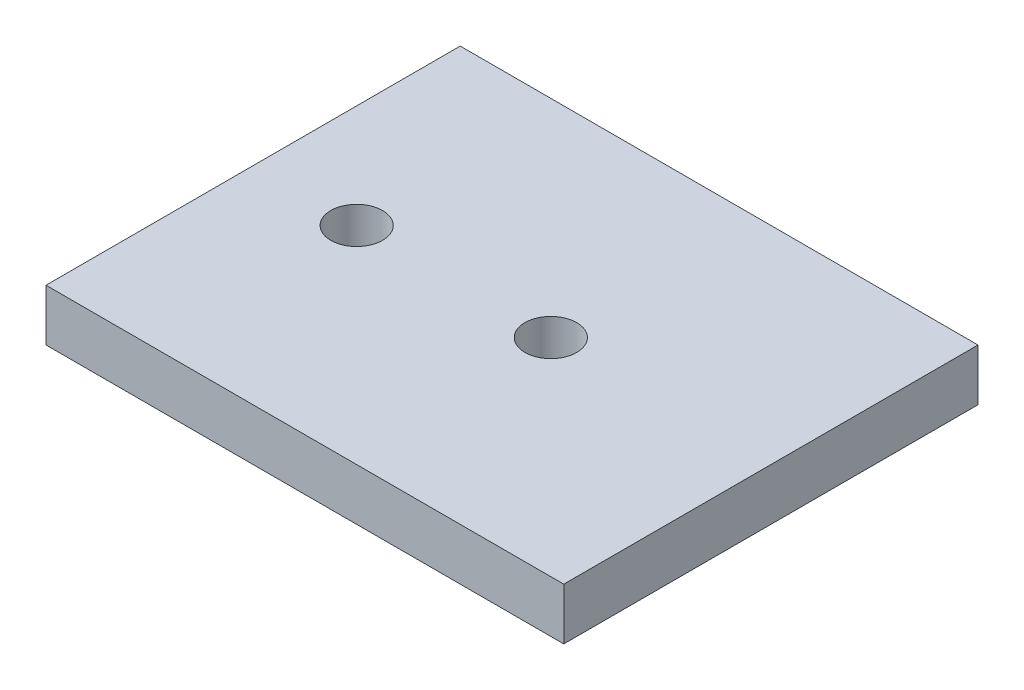
ISO-10303-21;
HEADER;
FILE_DESCRIPTION(('STEP AP214'),'2;1');
FILE_NAME('part.step','',(''),(''),'','','');
FILE_SCHEMA(('AUTOMOTIVE_DESIGN { 1 0 10303 214 1 1 1 1 }'));
ENDSEC;
DATA;
#1=APPLICATION_CONTEXT('core data for automotive mechanical design processes');
#2=APPLICATION_PROTOCOL_DEFINITION('international standard','automotive_design',2000,#1);
#3=PRODUCT_CONTEXT('',#1,'mechanical');
#4=PRODUCT('Part','Part','',(#3));
#5=PRODUCT_RELATED_PRODUCT_CATEGORY('part','',(#4));
#6=PRODUCT_DEFINITION_FORMATION('','',#4);
#7=PRODUCT_DEFINITION_CONTEXT('part definition',#1,'design');
#8=PRODUCT_DEFINITION('design','',#6,#7);
#9=PRODUCT_DEFINITION_SHAPE('','',#8);
#10=(LENGTH_UNIT() NAMED_UNIT(*) SI_UNIT(.MILLI.,.METRE.));
#11=(NAMED_UNIT(*) PLANE_ANGLE_UNIT() SI_UNIT($,.RADIAN.));
#12=(NAMED_UNIT(*) SI_UNIT($,.STERADIAN.) SOLID_ANGLE_UNIT());
#13=UNCERTAINTY_MEASURE_WITH_UNIT(LENGTH_MEASURE(1.E-05),#10,'distance_accuracy_value','');
#14=(GEOMETRIC_REPRESENTATION_CONTEXT(3) GLOBAL_UNCERTAINTY_ASSIGNED_CONTEXT((#13)) GLOBAL_UNIT_ASSIGNED_CONTEXT((#10,
#11,#12)) REPRESENTATION_CONTEXT('',''));
#15=CARTESIAN_POINT('',(0.,0.,0.));
#16=DIRECTION('',(0.,0.,1.));
#17=DIRECTION('',(1.,0.,0.));
#18=AXIS2_PLACEMENT_3D('',#15,#16,#17);
#19=CARTESIAN_POINT('',(63.5,12.7,50.8));
#20=DIRECTION('',(-1.,0.,0.));
#21=DIRECTION('',(0.,0.,1.));
#22=AXIS2_PLACEMENT_3D('',#19,#20,#21);
#23=PLANE('',#22);
#24=DIRECTION('',(0.,0.,-1.));
#25=VECTOR('',#24,1.);
#26=CARTESIAN_POINT('',(63.5,0.,50.8));
#27=LINE('',#26,#25);
#28=CARTESIAN_POINT('',(63.5,0.,50.8));
#29=VERTEX_POINT('',#28);
#30=CARTESIAN_POINT('',(63.5,0.,-50.8));
#31=VERTEX_POINT('',#30);
#32=EDGE_CURVE('E97',#29,#31,#27,.T.);
#33=ORIENTED_EDGE('',*,*,#32,.T.);
#34=DIRECTION('',(0.,-1.,0.));
#35=VECTOR('',#34,1.);
#36=CARTESIAN_POINT('',(63.5,12.7,-50.8));
#37=LINE('',#36,#35);
#38=CARTESIAN_POINT('',(63.5,12.7,-50.8));
#39=VERTEX_POINT('',#38);
#40=EDGE_CURVE('E11',#39,#31,#37,.T.);
#41=ORIENTED_EDGE('',*,*,#40,.F.);
#42=DIRECTION('',(0.,0.,-1.));
#43=VECTOR('',#42,1.);
#44=CARTESIAN_POINT('',(63.5,12.7,50.8));
#45=LINE('',#44,#43);
#46=CARTESIAN_POINT('',(63.5,12.7,50.8));
#47=VERTEX_POINT('',#46);
#48=EDGE_CURVE('E85',#47,#39,#45,.T.);
#49=ORIENTED_EDGE('',*,*,#48,.F.);
#50=DIRECTION('',(0.,-1.,0.));
#51=VECTOR('',#50,1.);
#52=CARTESIAN_POINT('',(63.5,12.7,50.8));
#53=LINE('',#52,#51);
#54=EDGE_CURVE('E93',#47,#29,#53,.T.);
#55=ORIENTED_EDGE('',*,*,#54,.T.);
#56=EDGE_LOOP('',(#33,#41,#49,#55));
#57=FACE_BOUND('',#56,.T.);
#58=ADVANCED_FACE('F34',(#57),#23,.F.);
#59=CARTESIAN_POINT('',(-63.5,12.7,-50.8));
#60=DIRECTION('',(0.,0.,1.));
#61=DIRECTION('',(1.,0.,0.));
#62=AXIS2_PLACEMENT_3D('',#59,#60,#61);
#63=PLANE('',#62);
#64=DIRECTION('',(-1.,0.,0.));
#65=VECTOR('',#64,1.);
#66=CARTESIAN_POINT('',(-63.5,0.,-50.8));
#67=LINE('',#66,#65);
#68=CARTESIAN_POINT('',(-63.5,0.,-50.8));
#69=VERTEX_POINT('',#68);
#70=EDGE_CURVE('E89',#31,#69,#67,.T.);
#71=ORIENTED_EDGE('',*,*,#70,.T.);
#72=DIRECTION('',(0.,-1.,0.));
#73=VECTOR('',#72,1.);
#74=CARTESIAN_POINT('',(-63.5,12.7,-50.8));
#75=LINE('',#74,#73);
#76=CARTESIAN_POINT('',(-63.5,12.7,-50.8));
#77=VERTEX_POINT('',#76);
#78=EDGE_CURVE('E42',#77,#69,#75,.T.);
#79=ORIENTED_EDGE('',*,*,#78,.F.);
#80=DIRECTION('',(-1.,0.,0.));
#81=VECTOR('',#80,1.);
#82=CARTESIAN_POINT('',(-63.5,12.7,-50.8));
#83=LINE('',#82,#81);
#84=EDGE_CURVE('E80',#39,#77,#83,.T.);
#85=ORIENTED_EDGE('',*,*,#84,.F.);
#86=ORIENTED_EDGE('',*,*,#40,.T.);
#87=EDGE_LOOP('',(#71,#79,#85,#86));
#88=FACE_BOUND('',#87,.T.);
#89=ADVANCED_FACE('F88',(#88),#63,.F.);
#90=CARTESIAN_POINT('',(-63.5,12.7,50.8));
#91=DIRECTION('',(1.,0.,0.));
#92=DIRECTION('',(0.,0.,-1.));
#93=AXIS2_PLACEMENT_3D('',#90,#91,#92);
#94=PLANE('',#93);
#95=DIRECTION('',(0.,0.,1.));
#96=VECTOR('',#95,1.);
#97=CARTESIAN_POINT('',(-63.5,0.,50.8));
#98=LINE('',#97,#96);
#99=CARTESIAN_POINT('',(-63.5,0.,50.8));
#100=VERTEX_POINT('',#99);
#101=EDGE_CURVE('E67',#69,#100,#98,.T.);
#102=ORIENTED_EDGE('',*,*,#101,.T.);
#103=DIRECTION('',(0.,-1.,0.));
#104=VECTOR('',#103,1.);
#105=CARTESIAN_POINT('',(-63.5,12.7,50.8));
#106=LINE('',#105,#104);
#107=CARTESIAN_POINT('',(-63.5,12.7,50.8));
#108=VERTEX_POINT('',#107);
#109=EDGE_CURVE('E90',#108,#100,#106,.T.);
#110=ORIENTED_EDGE('',*,*,#109,.F.);
#111=DIRECTION('',(0.,0.,1.));
#112=VECTOR('',#111,1.);
#113=CARTESIAN_POINT('',(-63.5,12.7,50.8));
#114=LINE('',#113,#112);
#115=EDGE_CURVE('E83',#77,#108,#114,.T.);
#116=ORIENTED_EDGE('',*,*,#115,.F.);
#117=ORIENTED_EDGE('',*,*,#78,.T.);
#118=EDGE_LOOP('',(#102,#110,#116,#117));
#119=FACE_BOUND('',#118,.T.);
#120=ADVANCED_FACE('F91',(#119),#94,.F.);
#121=CARTESIAN_POINT('',(-63.5,12.7,50.8));
#122=DIRECTION('',(0.,0.,-1.));
#123=DIRECTION('',(-1.,0.,0.));
#124=AXIS2_PLACEMENT_3D('',#121,#122,#123);
#125=PLANE('',#124);
#126=DIRECTION('',(1.,0.,0.));
#127=VECTOR('',#126,1.);
#128=CARTESIAN_POINT('',(-63.5,0.,50.8));
#129=LINE('',#128,#127);
#130=EDGE_CURVE('E73',#100,#29,#129,.T.);
#131=ORIENTED_EDGE('',*,*,#130,.T.);
#132=ORIENTED_EDGE('',*,*,#54,.F.);
#133=DIRECTION('',(1.,0.,0.));
#134=VECTOR('',#133,1.);
#135=CARTESIAN_POINT('',(-63.5,12.7,50.8));
#136=LINE('',#135,#134);
#137=EDGE_CURVE('E50',#108,#47,#136,.T.);
#138=ORIENTED_EDGE('',*,*,#137,.F.);
#139=ORIENTED_EDGE('',*,*,#109,.T.);
#140=EDGE_LOOP('',(#131,#132,#138,#139));
#141=FACE_BOUND('',#140,.T.);
#142=ADVANCED_FACE('F105',(#141),#125,.F.);
#143=CARTESIAN_POINT('',(0.,12.7,0.));
#144=DIRECTION('',(0.,-1.,0.));
#145=DIRECTION('',(0.,0.,-1.));
#146=AXIS2_PLACEMENT_3D('',#143,#144,#145);
#147=PLANE('',#146);
#148=CARTESIAN_POINT('',(-38.1,12.7,0.));
#149=DIRECTION('',(0.,1.,0.));
#150=DIRECTION('',(0.,0.,1.));
#151=AXIS2_PLACEMENT_3D('',#148,#149,#150);
#152=CIRCLE('',#151,6.35);
#153=CARTESIAN_POINT('',(-38.1,12.7,6.35));
#154=VERTEX_POINT('',#153);
#155=EDGE_CURVE('E117',#154,#154,#152,.T.);
#156=ORIENTED_EDGE('',*,*,#155,.F.);
#157=EDGE_LOOP('',(#156));
#158=FACE_BOUND('',#157,.T.);
#159=CARTESIAN_POINT('',(9.525,12.7,0.));
#160=DIRECTION('',(0.,1.,0.));
#161=DIRECTION('',(0.,0.,1.));
#162=AXIS2_PLACEMENT_3D('',#159,#160,#161);
#163=CIRCLE('',#162,6.35);
#164=CARTESIAN_POINT('',(9.525,12.7,6.35));
#165=VERTEX_POINT('',#164);
#166=EDGE_CURVE('E111',#165,#165,#163,.T.);
#167=ORIENTED_EDGE('',*,*,#166,.F.);
#168=EDGE_LOOP('',(#167));
#169=FACE_BOUND('',#168,.T.);
#170=ORIENTED_EDGE('',*,*,#48,.T.);
#171=ORIENTED_EDGE('',*,*,#84,.T.);
#172=ORIENTED_EDGE('',*,*,#115,.T.);
#173=ORIENTED_EDGE('',*,*,#137,.T.);
#174=EDGE_LOOP('',(#170,#171,#172,#173));
#175=FACE_BOUND('',#174,.T.);
#176=ADVANCED_FACE('F81',(#158,#169,#175),#147,.F.);
#177=CARTESIAN_POINT('',(0.,0.,0.));
#178=DIRECTION('',(0.,-1.,0.));
#179=DIRECTION('',(0.,0.,-1.));
#180=AXIS2_PLACEMENT_3D('',#177,#178,#179);
#181=PLANE('',#180);
#182=CARTESIAN_POINT('',(-38.1,0.,0.));
#183=DIRECTION('',(0.,1.,0.));
#184=DIRECTION('',(0.,0.,1.));
#185=AXIS2_PLACEMENT_3D('',#182,#183,#184);
#186=CIRCLE('',#185,6.35);
#187=CARTESIAN_POINT('',(-38.1,0.,6.35));
#188=VERTEX_POINT('',#187);
#189=EDGE_CURVE('E100',#188,#188,#186,.T.);
#190=ORIENTED_EDGE('',*,*,#189,.T.);
#191=EDGE_LOOP('',(#190));
#192=FACE_BOUND('',#191,.T.);
#193=CARTESIAN_POINT('',(9.525,0.,0.));
#194=DIRECTION('',(0.,1.,0.));
#195=DIRECTION('',(0.,0.,1.));
#196=AXIS2_PLACEMENT_3D('',#193,#194,#195);
#197=CIRCLE('',#196,6.35);
#198=CARTESIAN_POINT('',(9.525,0.,6.35));
#199=VERTEX_POINT('',#198);
#200=EDGE_CURVE('E114',#199,#199,#197,.T.);
#201=ORIENTED_EDGE('',*,*,#200,.T.);
#202=EDGE_LOOP('',(#201));
#203=FACE_BOUND('',#202,.T.);
#204=ORIENTED_EDGE('',*,*,#32,.F.);
#205=ORIENTED_EDGE('',*,*,#130,.F.);
#206=ORIENTED_EDGE('',*,*,#101,.F.);
#207=ORIENTED_EDGE('',*,*,#70,.F.);
#208=EDGE_LOOP('',(#204,#205,#206,#207));
#209=FACE_BOUND('',#208,.T.);
#210=ADVANCED_FACE('F108',(#192,#203,#209),#181,.T.);
#211=CARTESIAN_POINT('',(9.525,0.,0.));
#212=DIRECTION('',(0.,1.,0.));
#213=DIRECTION('',(0.,0.,1.));
#214=AXIS2_PLACEMENT_3D('',#211,#212,#213);
#215=CYLINDRICAL_SURFACE('',#214,6.35);
#216=ORIENTED_EDGE('',*,*,#200,.F.);
#217=EDGE_LOOP('',(#216));
#218=FACE_BOUND('',#217,.T.);
#219=ORIENTED_EDGE('',*,*,#166,.T.);
#220=EDGE_LOOP('',(#219));
#221=FACE_BOUND('',#220,.T.);
#222=ADVANCED_FACE('F128',(#218,#221),#215,.F.);
#223=CARTESIAN_POINT('',(-38.1,0.,0.));
#224=DIRECTION('',(0.,1.,0.));
#225=DIRECTION('',(0.,0.,1.));
#226=AXIS2_PLACEMENT_3D('',#223,#224,#225);
#227=CYLINDRICAL_SURFACE('',#226,6.35);
#228=ORIENTED_EDGE('',*,*,#189,.F.);
#229=EDGE_LOOP('',(#228));
#230=FACE_BOUND('',#229,.T.);
#231=ORIENTED_EDGE('',*,*,#155,.T.);
#232=EDGE_LOOP('',(#231));
#233=FACE_BOUND('',#232,.T.);
#234=ADVANCED_FACE('F125',(#230,#233),#227,.F.);
#235=CLOSED_SHELL('',(#58,#89,#120,#142,#176,#210,#222,#234));
#236=MANIFOLD_SOLID_BREP('B2',#235);
#237=ADVANCED_BREP_SHAPE_REPRESENTATION('',(#18,#236),#14);
#238=SHAPE_DEFINITION_REPRESENTATION(#9,#237);
ENDSEC;
END-ISO-10303-21;
